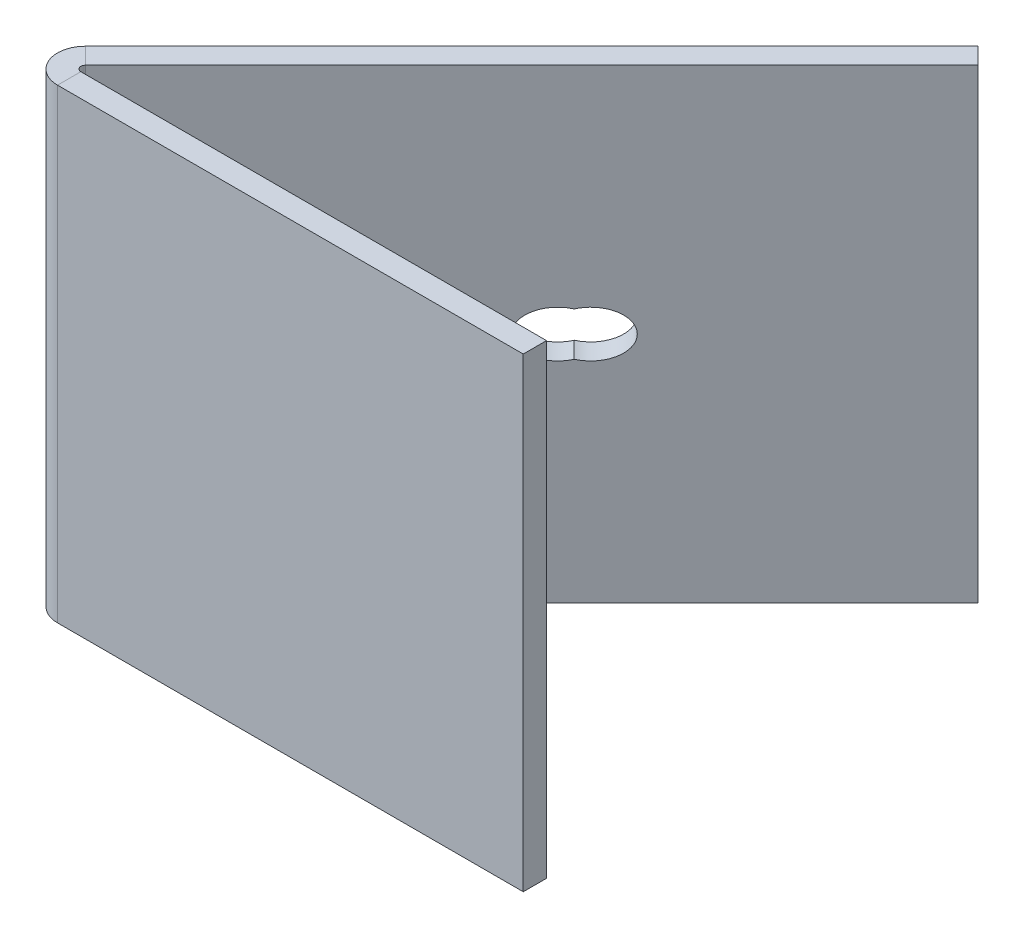
ISO-10303-21;
HEADER;
FILE_DESCRIPTION(('STEP AP214'),'2;1');
FILE_NAME('part.step','',(''),(''),'','','');
FILE_SCHEMA(('AUTOMOTIVE_DESIGN { 1 0 10303 214 1 1 1 1 }'));
ENDSEC;
DATA;
#1=APPLICATION_CONTEXT('core data for automotive mechanical design processes');
#2=APPLICATION_PROTOCOL_DEFINITION('international standard','automotive_design',2000,#1);
#3=PRODUCT_CONTEXT('',#1,'mechanical');
#4=PRODUCT('Part','Part','',(#3));
#5=PRODUCT_RELATED_PRODUCT_CATEGORY('part','',(#4));
#6=PRODUCT_DEFINITION_FORMATION('','',#4);
#7=PRODUCT_DEFINITION_CONTEXT('part definition',#1,'design');
#8=PRODUCT_DEFINITION('design','',#6,#7);
#9=PRODUCT_DEFINITION_SHAPE('','',#8);
#10=(LENGTH_UNIT() NAMED_UNIT(*) SI_UNIT(.MILLI.,.METRE.));
#11=(NAMED_UNIT(*) PLANE_ANGLE_UNIT() SI_UNIT($,.RADIAN.));
#12=(NAMED_UNIT(*) SI_UNIT($,.STERADIAN.) SOLID_ANGLE_UNIT());
#13=UNCERTAINTY_MEASURE_WITH_UNIT(LENGTH_MEASURE(1.E-05),#10,'distance_accuracy_value','');
#14=(GEOMETRIC_REPRESENTATION_CONTEXT(3) GLOBAL_UNCERTAINTY_ASSIGNED_CONTEXT((#13)) GLOBAL_UNIT_ASSIGNED_CONTEXT((#10,
#11,#12)) REPRESENTATION_CONTEXT('',''));
#15=CARTESIAN_POINT('',(0.,0.,0.));
#16=DIRECTION('',(0.,0.,1.));
#17=DIRECTION('',(1.,0.,0.));
#18=AXIS2_PLACEMENT_3D('',#15,#16,#17);
#19=CARTESIAN_POINT('',(50.,-50.,-5.));
#20=DIRECTION('',(1.,0.,0.));
#21=DIRECTION('',(0.,0.,-1.));
#22=AXIS2_PLACEMENT_3D('',#19,#20,#21);
#23=PLANE('',#22);
#24=DIRECTION('',(0.,1.,0.));
#25=VECTOR('',#24,1.);
#26=CARTESIAN_POINT('',(50.,-50.,0.));
#27=LINE('',#26,#25);
#28=CARTESIAN_POINT('',(50.,-50.,0.));
#29=VERTEX_POINT('',#28);
#30=CARTESIAN_POINT('',(50.,50.,0.));
#31=VERTEX_POINT('',#30);
#32=EDGE_CURVE('E217',#29,#31,#27,.T.);
#33=ORIENTED_EDGE('',*,*,#32,.F.);
#34=DIRECTION('',(0.,0.,1.));
#35=VECTOR('',#34,1.);
#36=CARTESIAN_POINT('',(50.,-50.,-5.));
#37=LINE('',#36,#35);
#38=CARTESIAN_POINT('',(50.,-50.,-5.));
#39=VERTEX_POINT('',#38);
#40=EDGE_CURVE('E13',#39,#29,#37,.T.);
#41=ORIENTED_EDGE('',*,*,#40,.F.);
#42=DIRECTION('',(0.,1.,0.));
#43=VECTOR('',#42,1.);
#44=CARTESIAN_POINT('',(50.,-50.,-5.));
#45=LINE('',#44,#43);
#46=CARTESIAN_POINT('',(50.,50.,-5.));
#47=VERTEX_POINT('',#46);
#48=EDGE_CURVE('E230',#39,#47,#45,.T.);
#49=ORIENTED_EDGE('',*,*,#48,.T.);
#50=DIRECTION('',(0.,0.,1.));
#51=VECTOR('',#50,1.);
#52=CARTESIAN_POINT('',(50.,50.,-5.));
#53=LINE('',#52,#51);
#54=EDGE_CURVE('E60',#47,#31,#53,.T.);
#55=ORIENTED_EDGE('',*,*,#54,.T.);
#56=EDGE_LOOP('',(#33,#41,#49,#55));
#57=FACE_BOUND('',#56,.T.);
#58=ADVANCED_FACE('F57',(#57),#23,.T.);
#59=CARTESIAN_POINT('',(-50.,-50.,-5.));
#60=DIRECTION('',(0.,-1.,0.));
#61=DIRECTION('',(0.,0.,-1.));
#62=AXIS2_PLACEMENT_3D('',#59,#60,#61);
#63=PLANE('',#62);
#64=DIRECTION('',(1.,0.,0.));
#65=VECTOR('',#64,1.);
#66=CARTESIAN_POINT('',(-50.,-50.,0.));
#67=LINE('',#66,#65);
#68=CARTESIAN_POINT('',(-50.,-50.,0.));
#69=VERTEX_POINT('',#68);
#70=EDGE_CURVE('E227',#69,#29,#67,.T.);
#71=ORIENTED_EDGE('',*,*,#70,.F.);
#72=DIRECTION('',(0.,0.,1.));
#73=VECTOR('',#72,1.);
#74=CARTESIAN_POINT('',(-50.,-50.,-5.));
#75=LINE('',#74,#73);
#76=CARTESIAN_POINT('',(-50.,-50.,-4.99999999999999));
#77=VERTEX_POINT('',#76);
#78=EDGE_CURVE('E65',#77,#69,#75,.T.);
#79=ORIENTED_EDGE('',*,*,#78,.F.);
#80=DIRECTION('',(1.,0.,0.));
#81=VECTOR('',#80,1.);
#82=CARTESIAN_POINT('',(-50.,-50.,-5.));
#83=LINE('',#82,#81);
#84=EDGE_CURVE('E241',#77,#39,#83,.T.);
#85=ORIENTED_EDGE('',*,*,#84,.T.);
#86=ORIENTED_EDGE('',*,*,#40,.T.);
#87=EDGE_LOOP('',(#71,#79,#85,#86));
#88=FACE_BOUND('',#87,.T.);
#89=ADVANCED_FACE('F203',(#88),#63,.T.);
#90=CARTESIAN_POINT('',(-50.,50.,-5.));
#91=DIRECTION('',(0.,1.,0.));
#92=DIRECTION('',(0.,0.,1.));
#93=AXIS2_PLACEMENT_3D('',#90,#91,#92);
#94=PLANE('',#93);
#95=DIRECTION('',(-1.,0.,0.));
#96=VECTOR('',#95,1.);
#97=CARTESIAN_POINT('',(-50.,50.,0.));
#98=LINE('',#97,#96);
#99=CARTESIAN_POINT('',(-50.,50.,0.));
#100=VERTEX_POINT('',#99);
#101=EDGE_CURVE('E222',#31,#100,#98,.T.);
#102=ORIENTED_EDGE('',*,*,#101,.F.);
#103=ORIENTED_EDGE('',*,*,#54,.F.);
#104=DIRECTION('',(-1.,0.,0.));
#105=VECTOR('',#104,1.);
#106=CARTESIAN_POINT('',(-50.,50.,-5.));
#107=LINE('',#106,#105);
#108=CARTESIAN_POINT('',(-50.,50.,-4.99999999999999));
#109=VERTEX_POINT('',#108);
#110=EDGE_CURVE('E232',#47,#109,#107,.T.);
#111=ORIENTED_EDGE('',*,*,#110,.T.);
#112=DIRECTION('',(0.,0.,1.));
#113=VECTOR('',#112,1.);
#114=CARTESIAN_POINT('',(-50.,50.,-5.));
#115=LINE('',#114,#113);
#116=EDGE_CURVE('E238',#109,#100,#115,.T.);
#117=ORIENTED_EDGE('',*,*,#116,.T.);
#118=EDGE_LOOP('',(#102,#103,#111,#117));
#119=FACE_BOUND('',#118,.T.);
#120=ADVANCED_FACE('F198',(#119),#94,.T.);
#121=CARTESIAN_POINT('',(0.,0.,-5.));
#122=DIRECTION('',(0.,0.,-1.));
#123=DIRECTION('',(-1.,0.,0.));
#124=AXIS2_PLACEMENT_3D('',#121,#122,#123);
#125=PLANE('',#124);
#126=ORIENTED_EDGE('',*,*,#48,.F.);
#127=ORIENTED_EDGE('',*,*,#84,.F.);
#128=DIRECTION('',(0.,-1.,0.));
#129=VECTOR('',#128,1.);
#130=CARTESIAN_POINT('',(-50.,-50.,-5.));
#131=LINE('',#130,#129);
#132=EDGE_CURVE('E243',#109,#77,#131,.T.);
#133=ORIENTED_EDGE('',*,*,#132,.F.);
#134=ORIENTED_EDGE('',*,*,#110,.F.);
#135=EDGE_LOOP('',(#126,#127,#133,#134));
#136=FACE_BOUND('',#135,.T.);
#137=ADVANCED_FACE('F195',(#136),#125,.T.);
#138=CARTESIAN_POINT('',(0.,0.,0.));
#139=DIRECTION('',(0.,0.,-1.));
#140=DIRECTION('',(-1.,0.,0.));
#141=AXIS2_PLACEMENT_3D('',#138,#139,#140);
#142=PLANE('',#141);
#143=ORIENTED_EDGE('',*,*,#32,.T.);
#144=ORIENTED_EDGE('',*,*,#101,.T.);
#145=DIRECTION('',(0.,-1.,0.));
#146=VECTOR('',#145,1.);
#147=CARTESIAN_POINT('',(-50.,-50.,0.));
#148=LINE('',#147,#146);
#149=EDGE_CURVE('E228',#100,#69,#148,.T.);
#150=ORIENTED_EDGE('',*,*,#149,.T.);
#151=ORIENTED_EDGE('',*,*,#70,.T.);
#152=EDGE_LOOP('',(#143,#144,#150,#151));
#153=FACE_BOUND('',#152,.T.);
#154=ADVANCED_FACE('F190',(#153),#142,.F.);
#155=CARTESIAN_POINT('',(-50.,-50.,-6.));
#156=DIRECTION('',(0.,-1.,0.));
#157=DIRECTION('',(0.,0.,-1.));
#158=AXIS2_PLACEMENT_3D('',#155,#156,#157);
#159=PLANE('',#158);
#160=DIRECTION('',(0.707106781186549,0.,0.707106781186546));
#161=VECTOR('',#160,1.);
#162=CARTESIAN_POINT('',(-54.2426406871193,-50.,-10.2426406871193));
#163=LINE('',#162,#161);
#164=CARTESIAN_POINT('',(-50.7071067811866,-50.,-6.70710678118656));
#165=VERTEX_POINT('',#164);
#166=CARTESIAN_POINT('',(-54.2426406871193,-50.,-10.2426406871193));
#167=VERTEX_POINT('',#166);
#168=EDGE_CURVE('E147',#165,#167,#163,.F.);
#169=ORIENTED_EDGE('',*,*,#168,.F.);
#170=CARTESIAN_POINT('',(-50.,-50.,-6.));
#171=DIRECTION('',(0.,1.,0.));
#172=DIRECTION('',(0.,0.,1.));
#173=AXIS2_PLACEMENT_3D('',#170,#171,#172);
#174=CIRCLE('',#173,1.00000000000001);
#175=EDGE_CURVE('E254',#77,#165,#174,.F.);
#176=ORIENTED_EDGE('',*,*,#175,.F.);
#177=ORIENTED_EDGE('',*,*,#78,.T.);
#178=CARTESIAN_POINT('',(-50.,-50.,-6.));
#179=DIRECTION('',(0.,1.,0.));
#180=DIRECTION('',(0.,0.,1.));
#181=AXIS2_PLACEMENT_3D('',#178,#179,#180);
#182=CIRCLE('',#181,6.00000000000001);
#183=EDGE_CURVE('E223',#69,#167,#182,.F.);
#184=ORIENTED_EDGE('',*,*,#183,.T.);
#185=EDGE_LOOP('',(#169,#176,#177,#184));
#186=FACE_BOUND('',#185,.T.);
#187=ADVANCED_FACE('F187',(#186),#159,.T.);
#188=CARTESIAN_POINT('',(-50.,50.,-6.));
#189=DIRECTION('',(0.,-1.,0.));
#190=DIRECTION('',(0.,0.,-1.));
#191=AXIS2_PLACEMENT_3D('',#188,#189,#190);
#192=PLANE('',#191);
#193=CARTESIAN_POINT('',(-50.,50.,-6.));
#194=DIRECTION('',(0.,1.,0.));
#195=DIRECTION('',(0.,0.,1.));
#196=AXIS2_PLACEMENT_3D('',#193,#194,#195);
#197=CIRCLE('',#196,1.00000000000001);
#198=CARTESIAN_POINT('',(-50.7071067811866,50.,-6.70710678118656));
#199=VERTEX_POINT('',#198);
#200=EDGE_CURVE('E251',#199,#109,#197,.T.);
#201=ORIENTED_EDGE('',*,*,#200,.F.);
#202=DIRECTION('',(0.707106781186549,0.,0.707106781186546));
#203=VECTOR('',#202,1.);
#204=CARTESIAN_POINT('',(-50.7071067811866,50.,-6.70710678118655));
#205=LINE('',#204,#203);
#206=CARTESIAN_POINT('',(-54.2426406871193,50.,-10.2426406871193));
#207=VERTEX_POINT('',#206);
#208=EDGE_CURVE('E266',#199,#207,#205,.F.);
#209=ORIENTED_EDGE('',*,*,#208,.T.);
#210=CARTESIAN_POINT('',(-50.,50.,-6.));
#211=DIRECTION('',(0.,1.,0.));
#212=DIRECTION('',(0.,0.,1.));
#213=AXIS2_PLACEMENT_3D('',#210,#211,#212);
#214=CIRCLE('',#213,6.00000000000001);
#215=EDGE_CURVE('E257',#207,#100,#214,.T.);
#216=ORIENTED_EDGE('',*,*,#215,.T.);
#217=ORIENTED_EDGE('',*,*,#116,.F.);
#218=EDGE_LOOP('',(#201,#209,#216,#217));
#219=FACE_BOUND('',#218,.T.);
#220=ADVANCED_FACE('F182',(#219),#192,.F.);
#221=CARTESIAN_POINT('',(-50.,50.,-6.));
#222=DIRECTION('',(0.,1.,0.));
#223=DIRECTION('',(-0.707106781186549,0.,-0.707106781186546));
#224=AXIS2_PLACEMENT_3D('',#221,#222,#223);
#225=CYLINDRICAL_SURFACE('',#224,6.00000000000001);
#226=ORIENTED_EDGE('',*,*,#149,.F.);
#227=ORIENTED_EDGE('',*,*,#215,.F.);
#228=DIRECTION('',(0.,1.,0.));
#229=VECTOR('',#228,1.);
#230=CARTESIAN_POINT('',(-54.2426406871193,-50.,-10.2426406871193));
#231=LINE('',#230,#229);
#232=EDGE_CURVE('E269',#207,#167,#231,.F.);
#233=ORIENTED_EDGE('',*,*,#232,.T.);
#234=ORIENTED_EDGE('',*,*,#183,.F.);
#235=EDGE_LOOP('',(#226,#227,#233,#234));
#236=FACE_BOUND('',#235,.T.);
#237=ADVANCED_FACE('F179',(#236),#225,.T.);
#238=CARTESIAN_POINT('',(-50.,50.,-6.));
#239=DIRECTION('',(0.,1.,0.));
#240=DIRECTION('',(-0.707106781186549,0.,-0.707106781186546));
#241=AXIS2_PLACEMENT_3D('',#238,#239,#240);
#242=CYLINDRICAL_SURFACE('',#241,1.00000000000001);
#243=ORIENTED_EDGE('',*,*,#132,.T.);
#244=ORIENTED_EDGE('',*,*,#175,.T.);
#245=DIRECTION('',(0.,1.,0.));
#246=VECTOR('',#245,1.);
#247=CARTESIAN_POINT('',(-50.7071067811866,-50.,-6.70710678118655));
#248=LINE('',#247,#246);
#249=EDGE_CURVE('E264',#165,#199,#248,.T.);
#250=ORIENTED_EDGE('',*,*,#249,.T.);
#251=ORIENTED_EDGE('',*,*,#200,.T.);
#252=EDGE_LOOP('',(#243,#244,#250,#251));
#253=FACE_BOUND('',#252,.T.);
#254=ADVANCED_FACE('F177',(#253),#242,.F.);
#255=CARTESIAN_POINT('',(41.5807358037434,50.,-106.066017177982));
#256=DIRECTION('',(0.,-1.,0.));
#257=DIRECTION('',(0.,0.,-1.));
#258=AXIS2_PLACEMENT_3D('',#255,#256,#257);
#259=PLANE('',#258);
#260=ORIENTED_EDGE('',*,*,#208,.F.);
#261=DIRECTION('',(-0.707106781186546,0.,0.707106781186549));
#262=VECTOR('',#261,1.);
#263=CARTESIAN_POINT('',(45.1162697096761,50.,-102.53048327205));
#264=LINE('',#263,#262);
#265=CARTESIAN_POINT('',(45.1162697096761,50.,-102.53048327205));
#266=VERTEX_POINT('',#265);
#267=EDGE_CURVE('E271',#199,#266,#264,.F.);
#268=ORIENTED_EDGE('',*,*,#267,.T.);
#269=DIRECTION('',(0.707106781186549,0.,0.707106781186546));
#270=VECTOR('',#269,1.);
#271=CARTESIAN_POINT('',(41.5807358037434,50.,-106.066017177982));
#272=LINE('',#271,#270);
#273=CARTESIAN_POINT('',(41.5807358037434,50.,-106.066017177982));
#274=VERTEX_POINT('',#273);
#275=EDGE_CURVE('E153',#274,#266,#272,.T.);
#276=ORIENTED_EDGE('',*,*,#275,.F.);
#277=DIRECTION('',(0.707106781186546,0.,-0.707106781186549));
#278=VECTOR('',#277,1.);
#279=CARTESIAN_POINT('',(-33.4497474683059,50.,-31.0355339059327));
#280=LINE('',#279,#278);
#281=EDGE_CURVE('E278',#207,#274,#280,.T.);
#282=ORIENTED_EDGE('',*,*,#281,.F.);
#283=EDGE_LOOP('',(#260,#268,#276,#282));
#284=FACE_BOUND('',#283,.T.);
#285=ADVANCED_FACE('F170',(#284),#259,.F.);
#286=CARTESIAN_POINT('',(-55.9497474683059,-50.,-8.53553390593273));
#287=DIRECTION('',(0.,1.,0.));
#288=DIRECTION('',(0.,0.,1.));
#289=AXIS2_PLACEMENT_3D('',#286,#287,#288);
#290=PLANE('',#289);
#291=ORIENTED_EDGE('',*,*,#168,.T.);
#292=DIRECTION('',(-0.707106781186546,0.,0.707106781186549));
#293=VECTOR('',#292,1.);
#294=CARTESIAN_POINT('',(-33.4497474683059,-50.,-31.0355339059327));
#295=LINE('',#294,#293);
#296=CARTESIAN_POINT('',(41.5807358037434,-50.,-106.066017177982));
#297=VERTEX_POINT('',#296);
#298=EDGE_CURVE('E282',#297,#167,#295,.T.);
#299=ORIENTED_EDGE('',*,*,#298,.F.);
#300=DIRECTION('',(0.707106781186549,0.,0.707106781186546));
#301=VECTOR('',#300,1.);
#302=CARTESIAN_POINT('',(41.5807358037434,-50.,-106.066017177982));
#303=LINE('',#302,#301);
#304=CARTESIAN_POINT('',(45.1162697096761,-50.,-102.53048327205));
#305=VERTEX_POINT('',#304);
#306=EDGE_CURVE('E284',#297,#305,#303,.T.);
#307=ORIENTED_EDGE('',*,*,#306,.T.);
#308=DIRECTION('',(0.707106781186546,0.,-0.707106781186549));
#309=VECTOR('',#308,1.);
#310=CARTESIAN_POINT('',(-52.4142135623731,-50.,-5.));
#311=LINE('',#310,#309);
#312=EDGE_CURVE('E275',#305,#165,#311,.F.);
#313=ORIENTED_EDGE('',*,*,#312,.T.);
#314=EDGE_LOOP('',(#291,#299,#307,#313));
#315=FACE_BOUND('',#314,.T.);
#316=ADVANCED_FACE('F164',(#315),#290,.F.);
#317=CARTESIAN_POINT('',(-33.4497474683059,0.,-31.0355339059327));
#318=DIRECTION('',(0.707106781186549,0.,0.707106781186546));
#319=DIRECTION('',(0.707106781186546,0.,-0.707106781186549));
#320=AXIS2_PLACEMENT_3D('',#317,#318,#319);
#321=PLANE('',#320);
#322=CARTESIAN_POINT('',(-3.53553390593275,0.,-60.949747468306));
#323=DIRECTION('',(0.707106781186549,0.,0.707106781186546));
#324=DIRECTION('',(-0.707106781186546,0.,0.707106781186549));
#325=AXIS2_PLACEMENT_3D('',#322,#323,#324);
#326=ELLIPSE('',#325,7.07106781186549,5.);
#327=CARTESIAN_POINT('',(-1.76776695296637,-4.67707173346743,-62.7175144212724));
#328=VERTEX_POINT('',#327);
#329=CARTESIAN_POINT('',(-1.76776695296637,4.67707173346743,-62.7175144212724));
#330=VERTEX_POINT('',#329);
#331=EDGE_CURVE('E73',#328,#330,#326,.F.);
#332=ORIENTED_EDGE('',*,*,#331,.F.);
#333=CARTESIAN_POINT('',(0.,0.,-64.4852813742388));
#334=DIRECTION('',(0.707106781186549,0.,0.707106781186546));
#335=DIRECTION('',(-0.707106781186546,0.,0.707106781186549));
#336=AXIS2_PLACEMENT_3D('',#333,#334,#335);
#337=ELLIPSE('',#336,7.07106781186549,5.);
#338=EDGE_CURVE('E142',#330,#328,#337,.F.);
#339=ORIENTED_EDGE('',*,*,#338,.F.);
#340=EDGE_LOOP('',(#332,#339));
#341=FACE_BOUND('',#340,.T.);
#342=ORIENTED_EDGE('',*,*,#232,.F.);
#343=ORIENTED_EDGE('',*,*,#281,.T.);
#344=DIRECTION('',(0.,-1.,0.));
#345=VECTOR('',#344,1.);
#346=CARTESIAN_POINT('',(41.5807358037434,0.,-106.066017177982));
#347=LINE('',#346,#345);
#348=EDGE_CURVE('E280',#274,#297,#347,.T.);
#349=ORIENTED_EDGE('',*,*,#348,.T.);
#350=ORIENTED_EDGE('',*,*,#298,.T.);
#351=EDGE_LOOP('',(#342,#343,#349,#350));
#352=FACE_BOUND('',#351,.T.);
#353=ADVANCED_FACE('F161',(#341,#352),#321,.F.);
#354=CARTESIAN_POINT('',(-29.9142135623732,0.,-27.5));
#355=DIRECTION('',(0.707106781186549,0.,0.707106781186546));
#356=DIRECTION('',(0.707106781186546,0.,-0.707106781186549));
#357=AXIS2_PLACEMENT_3D('',#354,#355,#356);
#358=PLANE('',#357);
#359=CARTESIAN_POINT('',(3.53553390593275,0.,-60.9497474683061));
#360=DIRECTION('',(0.707106781186549,0.,0.707106781186546));
#361=DIRECTION('',(-0.707106781186546,0.,0.707106781186549));
#362=AXIS2_PLACEMENT_3D('',#359,#360,#361);
#363=ELLIPSE('',#362,7.07106781186549,5.);
#364=CARTESIAN_POINT('',(1.76776695296637,4.67707173346743,-59.1819805153397));
#365=VERTEX_POINT('',#364);
#366=CARTESIAN_POINT('',(1.76776695296637,-4.67707173346743,-59.1819805153397));
#367=VERTEX_POINT('',#366);
#368=EDGE_CURVE('E137',#365,#367,#363,.F.);
#369=ORIENTED_EDGE('',*,*,#368,.T.);
#370=CARTESIAN_POINT('',(0.,0.,-57.4142135623733));
#371=DIRECTION('',(0.707106781186549,0.,0.707106781186546));
#372=DIRECTION('',(-0.707106781186546,0.,0.707106781186549));
#373=AXIS2_PLACEMENT_3D('',#370,#371,#372);
#374=ELLIPSE('',#373,7.07106781186549,5.);
#375=EDGE_CURVE('E78',#367,#365,#374,.F.);
#376=ORIENTED_EDGE('',*,*,#375,.T.);
#377=EDGE_LOOP('',(#369,#376));
#378=FACE_BOUND('',#377,.T.);
#379=ORIENTED_EDGE('',*,*,#267,.F.);
#380=ORIENTED_EDGE('',*,*,#249,.F.);
#381=ORIENTED_EDGE('',*,*,#312,.F.);
#382=DIRECTION('',(0.,1.,0.));
#383=VECTOR('',#382,1.);
#384=CARTESIAN_POINT('',(45.1162697096761,-50.,-102.53048327205));
#385=LINE('',#384,#383);
#386=EDGE_CURVE('E273',#266,#305,#385,.F.);
#387=ORIENTED_EDGE('',*,*,#386,.F.);
#388=EDGE_LOOP('',(#379,#380,#381,#387));
#389=FACE_BOUND('',#388,.T.);
#390=ADVANCED_FACE('F144',(#378,#389),#358,.T.);
#391=CARTESIAN_POINT('',(41.5807358037434,-50.,-106.066017177982));
#392=DIRECTION('',(-0.707106781186546,0.,0.707106781186549));
#393=DIRECTION('',(0.707106781186549,0.,0.707106781186546));
#394=AXIS2_PLACEMENT_3D('',#391,#392,#393);
#395=PLANE('',#394);
#396=ORIENTED_EDGE('',*,*,#386,.T.);
#397=ORIENTED_EDGE('',*,*,#306,.F.);
#398=ORIENTED_EDGE('',*,*,#348,.F.);
#399=ORIENTED_EDGE('',*,*,#275,.T.);
#400=EDGE_LOOP('',(#396,#397,#398,#399));
#401=FACE_BOUND('',#400,.T.);
#402=ADVANCED_FACE('F159',(#401),#395,.F.);
#403=CARTESIAN_POINT('',(0.,0.,-57.4142135623733));
#404=DIRECTION('',(0.707106781186549,0.,0.707106781186546));
#405=DIRECTION('',(-0.707106781186546,0.,0.707106781186549));
#406=AXIS2_PLACEMENT_3D('',#403,#404,#405);
#407=ELLIPSE('',#406,7.07106781186549,5.);
#408=DIRECTION('',(0.707106781186549,0.,0.707106781186546));
#409=VECTOR('',#408,1.);
#410=SURFACE_OF_LINEAR_EXTRUSION('',#407,#409);
#411=DIRECTION('',(0.707106781186549,0.,0.707106781186546));
#412=VECTOR('',#411,1.);
#413=CARTESIAN_POINT('',(-1.76776695296638,-4.67707173346742,-62.7175144212724));
#414=LINE('',#413,#412);
#415=EDGE_CURVE('E136',#367,#328,#414,.F.);
#416=ORIENTED_EDGE('',*,*,#415,.T.);
#417=ORIENTED_EDGE('',*,*,#331,.T.);
#418=DIRECTION('',(0.707106781186549,0.,0.707106781186546));
#419=VECTOR('',#418,1.);
#420=CARTESIAN_POINT('',(-1.76776695296637,4.67707173346743,-62.7175144212724));
#421=LINE('',#420,#419);
#422=EDGE_CURVE('E131',#330,#365,#421,.T.);
#423=ORIENTED_EDGE('',*,*,#422,.T.);
#424=ORIENTED_EDGE('',*,*,#375,.F.);
#425=EDGE_LOOP('',(#416,#417,#423,#424));
#426=FACE_BOUND('',#425,.T.);
#427=ADVANCED_FACE('F133',(#426),#410,.F.);
#428=CARTESIAN_POINT('',(0.,0.,-64.4852813742388));
#429=DIRECTION('',(0.707106781186549,0.,0.707106781186546));
#430=DIRECTION('',(-0.707106781186546,0.,0.707106781186549));
#431=AXIS2_PLACEMENT_3D('',#428,#429,#430);
#432=ELLIPSE('',#431,7.07106781186549,5.);
#433=DIRECTION('',(0.707106781186549,0.,0.707106781186546));
#434=VECTOR('',#433,1.);
#435=SURFACE_OF_LINEAR_EXTRUSION('',#432,#434);
#436=ORIENTED_EDGE('',*,*,#368,.F.);
#437=ORIENTED_EDGE('',*,*,#422,.F.);
#438=ORIENTED_EDGE('',*,*,#338,.T.);
#439=ORIENTED_EDGE('',*,*,#415,.F.);
#440=EDGE_LOOP('',(#436,#437,#438,#439));
#441=FACE_BOUND('',#440,.T.);
#442=ADVANCED_FACE('F140',(#441),#435,.F.);
#443=CLOSED_SHELL('',(#58,#89,#120,#137,#154,#187,#220,#237,#254,#285,#316,#353,#390,#402,#427,#442));
#444=MANIFOLD_SOLID_BREP('B2',#443);
#445=ADVANCED_BREP_SHAPE_REPRESENTATION('',(#18,#444),#14);
#446=SHAPE_DEFINITION_REPRESENTATION(#9,#445);
ENDSEC;
END-ISO-10303-21;
